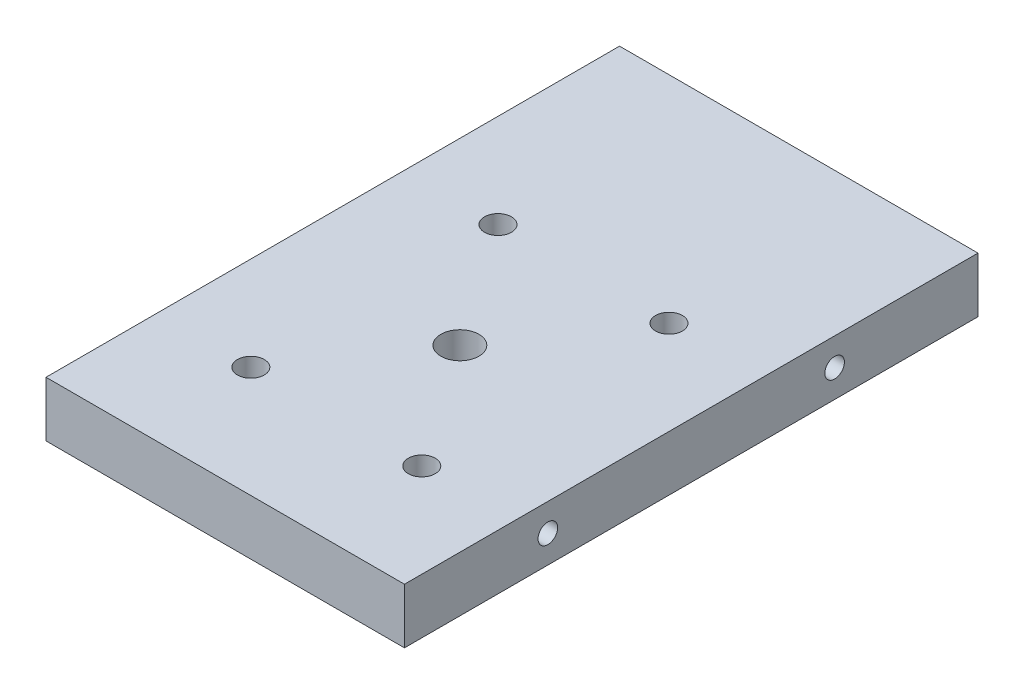
ISO-10303-21;
HEADER;
FILE_DESCRIPTION(('STEP AP214'),'2;1');
FILE_NAME('part.step','',(''),(''),'','','');
FILE_SCHEMA(('AUTOMOTIVE_DESIGN { 1 0 10303 214 1 1 1 1 }'));
ENDSEC;
DATA;
#1=APPLICATION_CONTEXT('core data for automotive mechanical design processes');
#2=APPLICATION_PROTOCOL_DEFINITION('international standard','automotive_design',2000,#1);
#3=PRODUCT_CONTEXT('',#1,'mechanical');
#4=PRODUCT('Part','Part','',(#3));
#5=PRODUCT_RELATED_PRODUCT_CATEGORY('part','',(#4));
#6=PRODUCT_DEFINITION_FORMATION('','',#4);
#7=PRODUCT_DEFINITION_CONTEXT('part definition',#1,'design');
#8=PRODUCT_DEFINITION('design','',#6,#7);
#9=PRODUCT_DEFINITION_SHAPE('','',#8);
#10=(LENGTH_UNIT() NAMED_UNIT(*) SI_UNIT(.MILLI.,.METRE.));
#11=(NAMED_UNIT(*) PLANE_ANGLE_UNIT() SI_UNIT($,.RADIAN.));
#12=(NAMED_UNIT(*) SI_UNIT($,.STERADIAN.) SOLID_ANGLE_UNIT());
#13=UNCERTAINTY_MEASURE_WITH_UNIT(LENGTH_MEASURE(1.E-05),#10,'distance_accuracy_value','');
#14=(GEOMETRIC_REPRESENTATION_CONTEXT(3) GLOBAL_UNCERTAINTY_ASSIGNED_CONTEXT((#13)) GLOBAL_UNIT_ASSIGNED_CONTEXT((#10,
#11,#12)) REPRESENTATION_CONTEXT('',''));
#15=CARTESIAN_POINT('',(0.,0.,0.));
#16=DIRECTION('',(0.,0.,1.));
#17=DIRECTION('',(1.,0.,0.));
#18=AXIS2_PLACEMENT_3D('',#15,#16,#17);
#19=CARTESIAN_POINT('',(0.,5.,0.));
#20=DIRECTION('',(1.,0.,0.));
#21=DIRECTION('',(0.,0.,-1.));
#22=AXIS2_PLACEMENT_3D('',#19,#20,#21);
#23=PLANE('',#22);
#24=CARTESIAN_POINT('',(0.,2.5,-39.));
#25=DIRECTION('',(-1.,0.,0.));
#26=DIRECTION('',(0.,0.,1.));
#27=AXIS2_PLACEMENT_3D('',#24,#25,#26);
#28=CIRCLE('',#27,0.889);
#29=CARTESIAN_POINT('',(0.,2.5,-38.111));
#30=VERTEX_POINT('',#29);
#31=EDGE_CURVE('E133',#30,#30,#28,.T.);
#32=ORIENTED_EDGE('',*,*,#31,.F.);
#33=EDGE_LOOP('',(#32));
#34=FACE_BOUND('',#33,.T.);
#35=CARTESIAN_POINT('',(0.,2.5,-13.));
#36=DIRECTION('',(-1.,0.,0.));
#37=DIRECTION('',(0.,0.,1.));
#38=AXIS2_PLACEMENT_3D('',#35,#36,#37);
#39=CIRCLE('',#38,0.889);
#40=CARTESIAN_POINT('',(0.,2.5,-12.111));
#41=VERTEX_POINT('',#40);
#42=EDGE_CURVE('E141',#41,#41,#39,.T.);
#43=ORIENTED_EDGE('',*,*,#42,.F.);
#44=EDGE_LOOP('',(#43));
#45=FACE_BOUND('',#44,.T.);
#46=DIRECTION('',(0.,0.,1.));
#47=VECTOR('',#46,1.);
#48=CARTESIAN_POINT('',(0.,0.,0.));
#49=LINE('',#48,#47);
#50=CARTESIAN_POINT('',(0.,0.,-52.));
#51=VERTEX_POINT('',#50);
#52=CARTESIAN_POINT('',(0.,0.,0.));
#53=VERTEX_POINT('',#52);
#54=EDGE_CURVE('E149',#51,#53,#49,.T.);
#55=ORIENTED_EDGE('',*,*,#54,.T.);
#56=DIRECTION('',(0.,-1.,0.));
#57=VECTOR('',#56,1.);
#58=CARTESIAN_POINT('',(0.,5.,0.));
#59=LINE('',#58,#57);
#60=CARTESIAN_POINT('',(0.,5.,0.));
#61=VERTEX_POINT('',#60);
#62=EDGE_CURVE('E11',#61,#53,#59,.T.);
#63=ORIENTED_EDGE('',*,*,#62,.F.);
#64=DIRECTION('',(0.,0.,1.));
#65=VECTOR('',#64,1.);
#66=CARTESIAN_POINT('',(0.,5.,0.));
#67=LINE('',#66,#65);
#68=CARTESIAN_POINT('',(0.,5.,-52.));
#69=VERTEX_POINT('',#68);
#70=EDGE_CURVE('E150',#69,#61,#67,.T.);
#71=ORIENTED_EDGE('',*,*,#70,.F.);
#72=DIRECTION('',(0.,-1.,0.));
#73=VECTOR('',#72,1.);
#74=CARTESIAN_POINT('',(0.,5.,-52.));
#75=LINE('',#74,#73);
#76=EDGE_CURVE('E160',#69,#51,#75,.T.);
#77=ORIENTED_EDGE('',*,*,#76,.T.);
#78=EDGE_LOOP('',(#55,#63,#71,#77));
#79=FACE_BOUND('',#78,.T.);
#80=ADVANCED_FACE('F45',(#34,#45,#79),#23,.F.);
#81=CARTESIAN_POINT('',(0.,5.,0.));
#82=DIRECTION('',(0.,0.,-1.));
#83=DIRECTION('',(-1.,0.,0.));
#84=AXIS2_PLACEMENT_3D('',#81,#82,#83);
#85=PLANE('',#84);
#86=DIRECTION('',(1.,0.,0.));
#87=VECTOR('',#86,1.);
#88=CARTESIAN_POINT('',(0.,0.,0.));
#89=LINE('',#88,#87);
#90=CARTESIAN_POINT('',(32.5,0.,0.));
#91=VERTEX_POINT('',#90);
#92=EDGE_CURVE('E164',#53,#91,#89,.T.);
#93=ORIENTED_EDGE('',*,*,#92,.T.);
#94=DIRECTION('',(0.,-1.,0.));
#95=VECTOR('',#94,1.);
#96=CARTESIAN_POINT('',(32.5,5.,0.));
#97=LINE('',#96,#95);
#98=CARTESIAN_POINT('',(32.5,5.,0.));
#99=VERTEX_POINT('',#98);
#100=EDGE_CURVE('E54',#99,#91,#97,.T.);
#101=ORIENTED_EDGE('',*,*,#100,.F.);
#102=DIRECTION('',(1.,0.,0.));
#103=VECTOR('',#102,1.);
#104=CARTESIAN_POINT('',(0.,5.,0.));
#105=LINE('',#104,#103);
#106=EDGE_CURVE('E93',#61,#99,#105,.T.);
#107=ORIENTED_EDGE('',*,*,#106,.F.);
#108=ORIENTED_EDGE('',*,*,#62,.T.);
#109=EDGE_LOOP('',(#93,#101,#107,#108));
#110=FACE_BOUND('',#109,.T.);
#111=ADVANCED_FACE('F194',(#110),#85,.F.);
#112=CARTESIAN_POINT('',(32.5,5.,0.));
#113=DIRECTION('',(-1.,0.,0.));
#114=DIRECTION('',(0.,0.,1.));
#115=AXIS2_PLACEMENT_3D('',#112,#113,#114);
#116=PLANE('',#115);
#117=CARTESIAN_POINT('',(32.5,2.5,-13.));
#118=DIRECTION('',(1.,0.,0.));
#119=DIRECTION('',(0.,0.,-1.));
#120=AXIS2_PLACEMENT_3D('',#117,#118,#119);
#121=CIRCLE('',#120,0.888999999999989);
#122=CARTESIAN_POINT('',(32.5,2.5,-13.889));
#123=VERTEX_POINT('',#122);
#124=EDGE_CURVE('E118',#123,#123,#121,.T.);
#125=ORIENTED_EDGE('',*,*,#124,.F.);
#126=EDGE_LOOP('',(#125));
#127=FACE_BOUND('',#126,.T.);
#128=CARTESIAN_POINT('',(32.5,2.5,-39.));
#129=DIRECTION('',(1.,0.,0.));
#130=DIRECTION('',(0.,0.,-1.));
#131=AXIS2_PLACEMENT_3D('',#128,#129,#130);
#132=CIRCLE('',#131,0.888999999999989);
#133=CARTESIAN_POINT('',(32.5,2.5,-39.889));
#134=VERTEX_POINT('',#133);
#135=EDGE_CURVE('E117',#134,#134,#132,.T.);
#136=ORIENTED_EDGE('',*,*,#135,.F.);
#137=EDGE_LOOP('',(#136));
#138=FACE_BOUND('',#137,.T.);
#139=DIRECTION('',(0.,0.,-1.));
#140=VECTOR('',#139,1.);
#141=CARTESIAN_POINT('',(32.5,0.,0.));
#142=LINE('',#141,#140);
#143=CARTESIAN_POINT('',(32.5,0.,-52.));
#144=VERTEX_POINT('',#143);
#145=EDGE_CURVE('E80',#91,#144,#142,.T.);
#146=ORIENTED_EDGE('',*,*,#145,.T.);
#147=DIRECTION('',(0.,-1.,0.));
#148=VECTOR('',#147,1.);
#149=CARTESIAN_POINT('',(32.5,5.,-52.));
#150=LINE('',#149,#148);
#151=CARTESIAN_POINT('',(32.5,5.,-52.));
#152=VERTEX_POINT('',#151);
#153=EDGE_CURVE('E173',#152,#144,#150,.T.);
#154=ORIENTED_EDGE('',*,*,#153,.F.);
#155=DIRECTION('',(0.,0.,-1.));
#156=VECTOR('',#155,1.);
#157=CARTESIAN_POINT('',(32.5,5.,0.));
#158=LINE('',#157,#156);
#159=EDGE_CURVE('E155',#99,#152,#158,.T.);
#160=ORIENTED_EDGE('',*,*,#159,.F.);
#161=ORIENTED_EDGE('',*,*,#100,.T.);
#162=EDGE_LOOP('',(#146,#154,#160,#161));
#163=FACE_BOUND('',#162,.T.);
#164=ADVANCED_FACE('F177',(#127,#138,#163),#116,.F.);
#165=CARTESIAN_POINT('',(0.,5.,-52.));
#166=DIRECTION('',(0.,0.,1.));
#167=DIRECTION('',(1.,0.,0.));
#168=AXIS2_PLACEMENT_3D('',#165,#166,#167);
#169=PLANE('',#168);
#170=DIRECTION('',(-1.,0.,0.));
#171=VECTOR('',#170,1.);
#172=CARTESIAN_POINT('',(0.,0.,-52.));
#173=LINE('',#172,#171);
#174=EDGE_CURVE('E86',#144,#51,#173,.T.);
#175=ORIENTED_EDGE('',*,*,#174,.T.);
#176=ORIENTED_EDGE('',*,*,#76,.F.);
#177=DIRECTION('',(-1.,0.,0.));
#178=VECTOR('',#177,1.);
#179=CARTESIAN_POINT('',(0.,5.,-52.));
#180=LINE('',#179,#178);
#181=EDGE_CURVE('E62',#152,#69,#180,.T.);
#182=ORIENTED_EDGE('',*,*,#181,.F.);
#183=ORIENTED_EDGE('',*,*,#153,.T.);
#184=EDGE_LOOP('',(#175,#176,#182,#183));
#185=FACE_BOUND('',#184,.T.);
#186=ADVANCED_FACE('F184',(#185),#169,.F.);
#187=CARTESIAN_POINT('',(0.,5.,0.));
#188=DIRECTION('',(0.,-1.,0.));
#189=DIRECTION('',(0.,0.,-1.));
#190=AXIS2_PLACEMENT_3D('',#187,#188,#189);
#191=PLANE('',#190);
#192=CARTESIAN_POINT('',(24.,5.,-32.48));
#193=DIRECTION('',(0.,1.,0.));
#194=DIRECTION('',(0.,0.,1.));
#195=AXIS2_PLACEMENT_3D('',#192,#193,#194);
#196=CIRCLE('',#195,1.22);
#197=CARTESIAN_POINT('',(24.,5.,-31.26));
#198=VERTEX_POINT('',#197);
#199=EDGE_CURVE('E265',#198,#198,#196,.T.);
#200=ORIENTED_EDGE('',*,*,#199,.F.);
#201=EDGE_LOOP('',(#200));
#202=FACE_BOUND('',#201,.T.);
#203=CARTESIAN_POINT('',(8.5,5.,-10.07));
#204=DIRECTION('',(0.,1.,0.));
#205=DIRECTION('',(0.,0.,1.));
#206=AXIS2_PLACEMENT_3D('',#203,#204,#205);
#207=CIRCLE('',#206,1.22);
#208=CARTESIAN_POINT('',(8.5,5.,-8.84999999999999));
#209=VERTEX_POINT('',#208);
#210=EDGE_CURVE('E259',#209,#209,#207,.T.);
#211=ORIENTED_EDGE('',*,*,#210,.F.);
#212=EDGE_LOOP('',(#211));
#213=FACE_BOUND('',#212,.T.);
#214=CARTESIAN_POINT('',(24.,5.,-10.07));
#215=DIRECTION('',(0.,1.,0.));
#216=DIRECTION('',(0.,0.,1.));
#217=AXIS2_PLACEMENT_3D('',#214,#215,#216);
#218=CIRCLE('',#217,1.22);
#219=CARTESIAN_POINT('',(24.,5.,-8.84999999999999));
#220=VERTEX_POINT('',#219);
#221=EDGE_CURVE('E271',#220,#220,#218,.T.);
#222=ORIENTED_EDGE('',*,*,#221,.F.);
#223=EDGE_LOOP('',(#222));
#224=FACE_BOUND('',#223,.T.);
#225=CARTESIAN_POINT('',(8.5,5.,-32.48));
#226=DIRECTION('',(0.,1.,0.));
#227=DIRECTION('',(0.,0.,1.));
#228=AXIS2_PLACEMENT_3D('',#225,#226,#227);
#229=CIRCLE('',#228,1.22);
#230=CARTESIAN_POINT('',(8.5,5.,-31.26));
#231=VERTEX_POINT('',#230);
#232=EDGE_CURVE('E253',#231,#231,#229,.T.);
#233=ORIENTED_EDGE('',*,*,#232,.F.);
#234=EDGE_LOOP('',(#233));
#235=FACE_BOUND('',#234,.T.);
#236=CARTESIAN_POINT('',(16.25,5.,-21.275));
#237=DIRECTION('',(0.,1.,0.));
#238=DIRECTION('',(0.,0.,1.));
#239=AXIS2_PLACEMENT_3D('',#236,#237,#238);
#240=CIRCLE('',#239,1.7272);
#241=CARTESIAN_POINT('',(16.25,5.,-19.5478));
#242=VERTEX_POINT('',#241);
#243=EDGE_CURVE('E248',#242,#242,#240,.T.);
#244=ORIENTED_EDGE('',*,*,#243,.F.);
#245=EDGE_LOOP('',(#244));
#246=FACE_BOUND('',#245,.T.);
#247=ORIENTED_EDGE('',*,*,#70,.T.);
#248=ORIENTED_EDGE('',*,*,#106,.T.);
#249=ORIENTED_EDGE('',*,*,#159,.T.);
#250=ORIENTED_EDGE('',*,*,#181,.T.);
#251=EDGE_LOOP('',(#247,#248,#249,#250));
#252=FACE_BOUND('',#251,.T.);
#253=ADVANCED_FACE('F186',(#202,#213,#224,#235,#246,#252),#191,.F.);
#254=CARTESIAN_POINT('',(0.,0.,0.));
#255=DIRECTION('',(0.,-1.,0.));
#256=DIRECTION('',(0.,0.,-1.));
#257=AXIS2_PLACEMENT_3D('',#254,#255,#256);
#258=PLANE('',#257);
#259=CARTESIAN_POINT('',(24.,0.,-32.48));
#260=DIRECTION('',(0.,1.,0.));
#261=DIRECTION('',(0.,0.,1.));
#262=AXIS2_PLACEMENT_3D('',#259,#260,#261);
#263=CIRCLE('',#262,1.22);
#264=CARTESIAN_POINT('',(24.,0.,-31.26));
#265=VERTEX_POINT('',#264);
#266=EDGE_CURVE('E231',#265,#265,#263,.T.);
#267=ORIENTED_EDGE('',*,*,#266,.T.);
#268=EDGE_LOOP('',(#267));
#269=FACE_BOUND('',#268,.T.);
#270=CARTESIAN_POINT('',(8.5,0.,-10.07));
#271=DIRECTION('',(0.,1.,0.));
#272=DIRECTION('',(0.,0.,1.));
#273=AXIS2_PLACEMENT_3D('',#270,#271,#272);
#274=CIRCLE('',#273,1.22);
#275=CARTESIAN_POINT('',(8.5,0.,-8.84999999999999));
#276=VERTEX_POINT('',#275);
#277=EDGE_CURVE('E235',#276,#276,#274,.T.);
#278=ORIENTED_EDGE('',*,*,#277,.T.);
#279=EDGE_LOOP('',(#278));
#280=FACE_BOUND('',#279,.T.);
#281=CARTESIAN_POINT('',(24.,0.,-10.07));
#282=DIRECTION('',(0.,1.,0.));
#283=DIRECTION('',(0.,0.,1.));
#284=AXIS2_PLACEMENT_3D('',#281,#282,#283);
#285=CIRCLE('',#284,1.22);
#286=CARTESIAN_POINT('',(24.,0.,-8.84999999999999));
#287=VERTEX_POINT('',#286);
#288=EDGE_CURVE('E239',#287,#287,#285,.T.);
#289=ORIENTED_EDGE('',*,*,#288,.T.);
#290=EDGE_LOOP('',(#289));
#291=FACE_BOUND('',#290,.T.);
#292=CARTESIAN_POINT('',(8.5,0.,-32.48));
#293=DIRECTION('',(0.,1.,0.));
#294=DIRECTION('',(0.,0.,1.));
#295=AXIS2_PLACEMENT_3D('',#292,#293,#294);
#296=CIRCLE('',#295,1.22);
#297=CARTESIAN_POINT('',(8.5,0.,-31.26));
#298=VERTEX_POINT('',#297);
#299=EDGE_CURVE('E243',#298,#298,#296,.T.);
#300=ORIENTED_EDGE('',*,*,#299,.T.);
#301=EDGE_LOOP('',(#300));
#302=FACE_BOUND('',#301,.T.);
#303=CARTESIAN_POINT('',(16.25,0.,-21.275));
#304=DIRECTION('',(0.,-1.,0.));
#305=DIRECTION('',(0.,0.,-1.));
#306=AXIS2_PLACEMENT_3D('',#303,#304,#305);
#307=CIRCLE('',#306,1.7272);
#308=CARTESIAN_POINT('',(16.25,0.,-23.0022));
#309=VERTEX_POINT('',#308);
#310=EDGE_CURVE('E126',#309,#309,#307,.T.);
#311=ORIENTED_EDGE('',*,*,#310,.F.);
#312=EDGE_LOOP('',(#311));
#313=FACE_BOUND('',#312,.T.);
#314=ORIENTED_EDGE('',*,*,#54,.F.);
#315=ORIENTED_EDGE('',*,*,#174,.F.);
#316=ORIENTED_EDGE('',*,*,#145,.F.);
#317=ORIENTED_EDGE('',*,*,#92,.F.);
#318=EDGE_LOOP('',(#314,#315,#316,#317));
#319=FACE_BOUND('',#318,.T.);
#320=ADVANCED_FACE('F180',(#269,#280,#291,#302,#313,#319),#258,.T.);
#321=CARTESIAN_POINT('',(7.4658349096845,2.5,-13.));
#322=DIRECTION('',(-1.,0.,0.));
#323=DIRECTION('',(0.,0.,1.));
#324=AXIS2_PLACEMENT_3D('',#321,#322,#323);
#325=CONICAL_SURFACE('',#324,0.888999999999998,1.02974425867665);
#326=CARTESIAN_POINT('',(8.,2.5,-13.));
#327=VERTEX_POINT('',#326);
#328=VERTEX_LOOP('',#327);
#329=FACE_BOUND('',#328,.T.);
#330=CARTESIAN_POINT('',(7.4658349096845,2.5,-13.));
#331=DIRECTION('',(-1.,0.,0.));
#332=DIRECTION('',(0.,0.,1.));
#333=AXIS2_PLACEMENT_3D('',#330,#331,#332);
#334=CIRCLE('',#333,0.888999999999998);
#335=CARTESIAN_POINT('',(7.4658349096845,2.5,-12.111));
#336=VERTEX_POINT('',#335);
#337=EDGE_CURVE('E145',#336,#336,#334,.T.);
#338=ORIENTED_EDGE('',*,*,#337,.T.);
#339=EDGE_LOOP('',(#338));
#340=FACE_BOUND('',#339,.T.);
#341=ADVANCED_FACE('F210',(#329,#340),#325,.F.);
#342=CARTESIAN_POINT('',(0.,2.5,-13.));
#343=DIRECTION('',(-1.,0.,0.));
#344=DIRECTION('',(0.,0.,1.));
#345=AXIS2_PLACEMENT_3D('',#342,#343,#344);
#346=CYLINDRICAL_SURFACE('',#345,0.888999999999999);
#347=ORIENTED_EDGE('',*,*,#337,.F.);
#348=EDGE_LOOP('',(#347));
#349=FACE_BOUND('',#348,.T.);
#350=ORIENTED_EDGE('',*,*,#42,.T.);
#351=EDGE_LOOP('',(#350));
#352=FACE_BOUND('',#351,.T.);
#353=ADVANCED_FACE('F207',(#349,#352),#346,.F.);
#354=CARTESIAN_POINT('',(7.4658349096845,2.5,-39.));
#355=DIRECTION('',(-1.,0.,0.));
#356=DIRECTION('',(0.,0.,1.));
#357=AXIS2_PLACEMENT_3D('',#354,#355,#356);
#358=CONICAL_SURFACE('',#357,0.888999999999998,1.02974425867665);
#359=CARTESIAN_POINT('',(8.,2.5,-39.));
#360=VERTEX_POINT('',#359);
#361=VERTEX_LOOP('',#360);
#362=FACE_BOUND('',#361,.T.);
#363=CARTESIAN_POINT('',(7.4658349096845,2.5,-39.));
#364=DIRECTION('',(-1.,0.,0.));
#365=DIRECTION('',(0.,0.,1.));
#366=AXIS2_PLACEMENT_3D('',#363,#364,#365);
#367=CIRCLE('',#366,0.888999999999998);
#368=CARTESIAN_POINT('',(7.4658349096845,2.5,-38.111));
#369=VERTEX_POINT('',#368);
#370=EDGE_CURVE('E137',#369,#369,#367,.T.);
#371=ORIENTED_EDGE('',*,*,#370,.T.);
#372=EDGE_LOOP('',(#371));
#373=FACE_BOUND('',#372,.T.);
#374=ADVANCED_FACE('F209',(#362,#373),#358,.F.);
#375=CARTESIAN_POINT('',(0.,2.5,-39.));
#376=DIRECTION('',(-1.,0.,0.));
#377=DIRECTION('',(0.,0.,1.));
#378=AXIS2_PLACEMENT_3D('',#375,#376,#377);
#379=CYLINDRICAL_SURFACE('',#378,0.888999999999999);
#380=ORIENTED_EDGE('',*,*,#370,.F.);
#381=EDGE_LOOP('',(#380));
#382=FACE_BOUND('',#381,.T.);
#383=ORIENTED_EDGE('',*,*,#31,.T.);
#384=EDGE_LOOP('',(#383));
#385=FACE_BOUND('',#384,.T.);
#386=ADVANCED_FACE('F217',(#382,#385),#379,.F.);
#387=CARTESIAN_POINT('',(25.0341650903155,2.5,-39.));
#388=DIRECTION('',(1.,0.,0.));
#389=DIRECTION('',(0.,0.,-1.));
#390=AXIS2_PLACEMENT_3D('',#387,#388,#389);
#391=CONICAL_SURFACE('',#390,0.888999999999998,1.02974425867665);
#392=CARTESIAN_POINT('',(24.5,2.5,-39.));
#393=VERTEX_POINT('',#392);
#394=VERTEX_LOOP('',#393);
#395=FACE_BOUND('',#394,.T.);
#396=CARTESIAN_POINT('',(25.0341650903155,2.5,-39.));
#397=DIRECTION('',(1.,0.,0.));
#398=DIRECTION('',(0.,0.,-1.));
#399=AXIS2_PLACEMENT_3D('',#396,#397,#398);
#400=CIRCLE('',#399,0.888999999999998);
#401=CARTESIAN_POINT('',(25.0341650903155,2.5,-39.889));
#402=VERTEX_POINT('',#401);
#403=EDGE_CURVE('E123',#402,#402,#400,.T.);
#404=ORIENTED_EDGE('',*,*,#403,.T.);
#405=EDGE_LOOP('',(#404));
#406=FACE_BOUND('',#405,.T.);
#407=ADVANCED_FACE('F300',(#395,#406),#391,.F.);
#408=CARTESIAN_POINT('',(32.5,2.5,-39.));
#409=DIRECTION('',(1.,0.,0.));
#410=DIRECTION('',(0.,0.,-1.));
#411=AXIS2_PLACEMENT_3D('',#408,#409,#410);
#412=CYLINDRICAL_SURFACE('',#411,0.888999999999994);
#413=ORIENTED_EDGE('',*,*,#403,.F.);
#414=EDGE_LOOP('',(#413));
#415=FACE_BOUND('',#414,.T.);
#416=ORIENTED_EDGE('',*,*,#135,.T.);
#417=EDGE_LOOP('',(#416));
#418=FACE_BOUND('',#417,.T.);
#419=ADVANCED_FACE('F110',(#415,#418),#412,.F.);
#420=CARTESIAN_POINT('',(25.0341650903155,2.5,-13.));
#421=DIRECTION('',(1.,0.,0.));
#422=DIRECTION('',(0.,0.,-1.));
#423=AXIS2_PLACEMENT_3D('',#420,#421,#422);
#424=CONICAL_SURFACE('',#423,0.888999999999998,1.02974425867665);
#425=CARTESIAN_POINT('',(24.5,2.5,-13.));
#426=VERTEX_POINT('',#425);
#427=VERTEX_LOOP('',#426);
#428=FACE_BOUND('',#427,.T.);
#429=CARTESIAN_POINT('',(25.0341650903155,2.5,-13.));
#430=DIRECTION('',(1.,0.,0.));
#431=DIRECTION('',(0.,0.,-1.));
#432=AXIS2_PLACEMENT_3D('',#429,#430,#431);
#433=CIRCLE('',#432,0.888999999999998);
#434=CARTESIAN_POINT('',(25.0341650903155,2.5,-13.889));
#435=VERTEX_POINT('',#434);
#436=EDGE_CURVE('E114',#435,#435,#433,.T.);
#437=ORIENTED_EDGE('',*,*,#436,.T.);
#438=EDGE_LOOP('',(#437));
#439=FACE_BOUND('',#438,.T.);
#440=ADVANCED_FACE('F106',(#428,#439),#424,.F.);
#441=CARTESIAN_POINT('',(32.5,2.5,-13.));
#442=DIRECTION('',(1.,0.,0.));
#443=DIRECTION('',(0.,0.,-1.));
#444=AXIS2_PLACEMENT_3D('',#441,#442,#443);
#445=CYLINDRICAL_SURFACE('',#444,0.888999999999994);
#446=ORIENTED_EDGE('',*,*,#436,.F.);
#447=EDGE_LOOP('',(#446));
#448=FACE_BOUND('',#447,.T.);
#449=ORIENTED_EDGE('',*,*,#124,.T.);
#450=EDGE_LOOP('',(#449));
#451=FACE_BOUND('',#450,.T.);
#452=ADVANCED_FACE('F109',(#448,#451),#445,.F.);
#453=CARTESIAN_POINT('',(16.25,5.,-21.275));
#454=DIRECTION('',(0.,1.,0.));
#455=DIRECTION('',(0.,0.,1.));
#456=AXIS2_PLACEMENT_3D('',#453,#454,#455);
#457=CYLINDRICAL_SURFACE('',#456,1.7272);
#458=ORIENTED_EDGE('',*,*,#310,.T.);
#459=EDGE_LOOP('',(#458));
#460=FACE_BOUND('',#459,.T.);
#461=ORIENTED_EDGE('',*,*,#243,.T.);
#462=EDGE_LOOP('',(#461));
#463=FACE_BOUND('',#462,.T.);
#464=ADVANCED_FACE('F285',(#460,#463),#457,.F.);
#465=CARTESIAN_POINT('',(8.5,0.,-32.48));
#466=DIRECTION('',(0.,1.,0.));
#467=DIRECTION('',(0.,0.,1.));
#468=AXIS2_PLACEMENT_3D('',#465,#466,#467);
#469=CYLINDRICAL_SURFACE('',#468,1.22);
#470=ORIENTED_EDGE('',*,*,#299,.F.);
#471=EDGE_LOOP('',(#470));
#472=FACE_BOUND('',#471,.T.);
#473=ORIENTED_EDGE('',*,*,#232,.T.);
#474=EDGE_LOOP('',(#473));
#475=FACE_BOUND('',#474,.T.);
#476=ADVANCED_FACE('F287',(#472,#475),#469,.F.);
#477=CARTESIAN_POINT('',(24.,0.,-10.07));
#478=DIRECTION('',(0.,1.,0.));
#479=DIRECTION('',(0.,0.,1.));
#480=AXIS2_PLACEMENT_3D('',#477,#478,#479);
#481=CYLINDRICAL_SURFACE('',#480,1.22);
#482=ORIENTED_EDGE('',*,*,#288,.F.);
#483=EDGE_LOOP('',(#482));
#484=FACE_BOUND('',#483,.T.);
#485=ORIENTED_EDGE('',*,*,#221,.T.);
#486=EDGE_LOOP('',(#485));
#487=FACE_BOUND('',#486,.T.);
#488=ADVANCED_FACE('F278',(#484,#487),#481,.F.);
#489=CARTESIAN_POINT('',(8.5,0.,-10.07));
#490=DIRECTION('',(0.,1.,0.));
#491=DIRECTION('',(0.,0.,1.));
#492=AXIS2_PLACEMENT_3D('',#489,#490,#491);
#493=CYLINDRICAL_SURFACE('',#492,1.22);
#494=ORIENTED_EDGE('',*,*,#277,.F.);
#495=EDGE_LOOP('',(#494));
#496=FACE_BOUND('',#495,.T.);
#497=ORIENTED_EDGE('',*,*,#210,.T.);
#498=EDGE_LOOP('',(#497));
#499=FACE_BOUND('',#498,.T.);
#500=ADVANCED_FACE('F373',(#496,#499),#493,.F.);
#501=CARTESIAN_POINT('',(24.,0.,-32.48));
#502=DIRECTION('',(0.,1.,0.));
#503=DIRECTION('',(0.,0.,1.));
#504=AXIS2_PLACEMENT_3D('',#501,#502,#503);
#505=CYLINDRICAL_SURFACE('',#504,1.22);
#506=ORIENTED_EDGE('',*,*,#266,.F.);
#507=EDGE_LOOP('',(#506));
#508=FACE_BOUND('',#507,.T.);
#509=ORIENTED_EDGE('',*,*,#199,.T.);
#510=EDGE_LOOP('',(#509));
#511=FACE_BOUND('',#510,.T.);
#512=ADVANCED_FACE('F383',(#508,#511),#505,.F.);
#513=CLOSED_SHELL('',(#80,#111,#164,#186,#253,#320,#341,#353,#374,#386,#407,#419,#440,#452,#464,
#476,#488,#500,#512));
#514=MANIFOLD_SOLID_BREP('B2',#513);
#515=ADVANCED_BREP_SHAPE_REPRESENTATION('',(#18,#514),#14);
#516=SHAPE_DEFINITION_REPRESENTATION(#9,#515);
ENDSEC;
END-ISO-10303-21;
